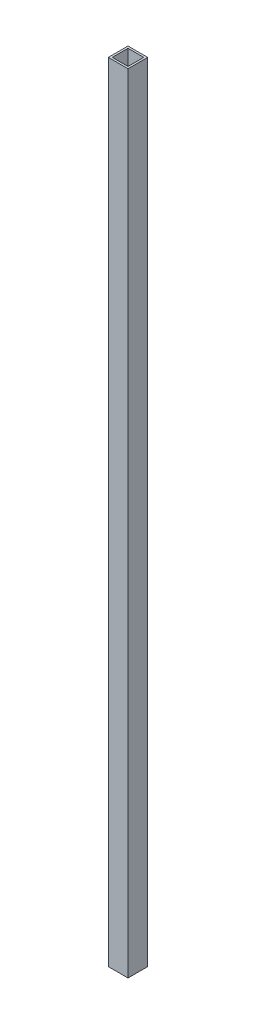
ISO-10303-21;
HEADER;
FILE_DESCRIPTION(('STEP AP214'),'2;1');
FILE_NAME('part.step','',(''),(''),'','','');
FILE_SCHEMA(('AUTOMOTIVE_DESIGN { 1 0 10303 214 1 1 1 1 }'));
ENDSEC;
DATA;
#1=APPLICATION_CONTEXT('core data for automotive mechanical design processes');
#2=APPLICATION_PROTOCOL_DEFINITION('international standard','automotive_design',2000,#1);
#3=PRODUCT_CONTEXT('',#1,'mechanical');
#4=PRODUCT('Part','Part','',(#3));
#5=PRODUCT_RELATED_PRODUCT_CATEGORY('part','',(#4));
#6=PRODUCT_DEFINITION_FORMATION('','',#4);
#7=PRODUCT_DEFINITION_CONTEXT('part definition',#1,'design');
#8=PRODUCT_DEFINITION('design','',#6,#7);
#9=PRODUCT_DEFINITION_SHAPE('','',#8);
#10=(LENGTH_UNIT() NAMED_UNIT(*) SI_UNIT(.MILLI.,.METRE.));
#11=(NAMED_UNIT(*) PLANE_ANGLE_UNIT() SI_UNIT($,.RADIAN.));
#12=(NAMED_UNIT(*) SI_UNIT($,.STERADIAN.) SOLID_ANGLE_UNIT());
#13=UNCERTAINTY_MEASURE_WITH_UNIT(LENGTH_MEASURE(1.E-05),#10,'distance_accuracy_value','');
#14=(GEOMETRIC_REPRESENTATION_CONTEXT(3) GLOBAL_UNCERTAINTY_ASSIGNED_CONTEXT((#13)) GLOBAL_UNIT_ASSIGNED_CONTEXT((#10,
#11,#12)) REPRESENTATION_CONTEXT('',''));
#15=CARTESIAN_POINT('',(0.,0.,0.));
#16=DIRECTION('',(0.,0.,1.));
#17=DIRECTION('',(1.,0.,0.));
#18=AXIS2_PLACEMENT_3D('',#15,#16,#17);
#19=CARTESIAN_POINT('',(-31.7391304347827,49.7826086956523,-20.));
#20=DIRECTION('',(-1.,0.,0.));
#21=DIRECTION('',(0.,-1.,0.));
#22=AXIS2_PLACEMENT_3D('',#19,#20,#21);
#23=PLANE('',#22);
#24=DIRECTION('',(0.,-1.,0.));
#25=VECTOR('',#24,1.);
#26=CARTESIAN_POINT('',(-31.7391304347827,49.7826086956523,0.));
#27=LINE('',#26,#25);
#28=CARTESIAN_POINT('',(-31.7391304347827,49.7826086956523,0.));
#29=VERTEX_POINT('',#28);
#30=CARTESIAN_POINT('',(-31.7391304347826,-750.217391304348,0.));
#31=VERTEX_POINT('',#30);
#32=EDGE_CURVE('E140',#29,#31,#27,.T.);
#33=ORIENTED_EDGE('',*,*,#32,.F.);
#34=DIRECTION('',(0.,0.,1.));
#35=VECTOR('',#34,1.);
#36=CARTESIAN_POINT('',(-31.7391304347827,49.7826086956523,-20.));
#37=LINE('',#36,#35);
#38=CARTESIAN_POINT('',(-31.7391304347827,49.7826086956523,-20.));
#39=VERTEX_POINT('',#38);
#40=EDGE_CURVE('E11',#39,#29,#37,.T.);
#41=ORIENTED_EDGE('',*,*,#40,.F.);
#42=DIRECTION('',(0.,-1.,0.));
#43=VECTOR('',#42,1.);
#44=CARTESIAN_POINT('',(-31.7391304347827,49.7826086956523,-20.));
#45=LINE('',#44,#43);
#46=CARTESIAN_POINT('',(-31.7391304347826,-750.217391304348,-20.));
#47=VERTEX_POINT('',#46);
#48=EDGE_CURVE('E144',#39,#47,#45,.T.);
#49=ORIENTED_EDGE('',*,*,#48,.T.);
#50=DIRECTION('',(0.,0.,1.));
#51=VECTOR('',#50,1.);
#52=CARTESIAN_POINT('',(-31.7391304347826,-750.217391304348,-20.));
#53=LINE('',#52,#51);
#54=EDGE_CURVE('E36',#47,#31,#53,.T.);
#55=ORIENTED_EDGE('',*,*,#54,.T.);
#56=EDGE_LOOP('',(#33,#41,#49,#55));
#57=FACE_BOUND('',#56,.T.);
#58=ADVANCED_FACE('F33',(#57),#23,.T.);
#59=CARTESIAN_POINT('',(-31.7391304347827,49.7826086956523,-20.));
#60=DIRECTION('',(0.,1.,0.));
#61=DIRECTION('',(0.,0.,1.));
#62=AXIS2_PLACEMENT_3D('',#59,#60,#61);
#63=PLANE('',#62);
#64=DIRECTION('',(0.,0.,1.));
#65=VECTOR('',#64,1.);
#66=CARTESIAN_POINT('',(-29.7391304347827,49.7826086956523,-18.));
#67=LINE('',#66,#65);
#68=CARTESIAN_POINT('',(-29.7391304347827,49.7826086956523,-18.));
#69=VERTEX_POINT('',#68);
#70=CARTESIAN_POINT('',(-29.7391304347827,49.7826086956523,-2.));
#71=VERTEX_POINT('',#70);
#72=EDGE_CURVE('E49',#69,#71,#67,.T.);
#73=ORIENTED_EDGE('',*,*,#72,.F.);
#74=DIRECTION('',(-1.,0.,0.));
#75=VECTOR('',#74,1.);
#76=CARTESIAN_POINT('',(-13.7391304347827,49.7826086956523,-18.));
#77=LINE('',#76,#75);
#78=CARTESIAN_POINT('',(-13.7391304347827,49.7826086956523,-18.));
#79=VERTEX_POINT('',#78);
#80=EDGE_CURVE('E125',#79,#69,#77,.T.);
#81=ORIENTED_EDGE('',*,*,#80,.F.);
#82=DIRECTION('',(0.,0.,-1.));
#83=VECTOR('',#82,1.);
#84=CARTESIAN_POINT('',(-13.7391304347827,49.7826086956523,-2.));
#85=LINE('',#84,#83);
#86=CARTESIAN_POINT('',(-13.7391304347827,49.7826086956523,-2.));
#87=VERTEX_POINT('',#86);
#88=EDGE_CURVE('E128',#87,#79,#85,.T.);
#89=ORIENTED_EDGE('',*,*,#88,.F.);
#90=DIRECTION('',(1.,0.,0.));
#91=VECTOR('',#90,1.);
#92=CARTESIAN_POINT('',(-29.7391304347827,49.7826086956523,-2.));
#93=LINE('',#92,#91);
#94=EDGE_CURVE('E134',#71,#87,#93,.T.);
#95=ORIENTED_EDGE('',*,*,#94,.F.);
#96=EDGE_LOOP('',(#73,#81,#89,#95));
#97=FACE_BOUND('',#96,.T.);
#98=DIRECTION('',(-1.,0.,0.));
#99=VECTOR('',#98,1.);
#100=CARTESIAN_POINT('',(-31.7391304347827,49.7826086956523,0.));
#101=LINE('',#100,#99);
#102=CARTESIAN_POINT('',(-11.7391304347827,49.7826086956523,0.));
#103=VERTEX_POINT('',#102);
#104=EDGE_CURVE('E147',#103,#29,#101,.T.);
#105=ORIENTED_EDGE('',*,*,#104,.F.);
#106=DIRECTION('',(0.,0.,1.));
#107=VECTOR('',#106,1.);
#108=CARTESIAN_POINT('',(-11.7391304347827,49.7826086956523,-20.));
#109=LINE('',#108,#107);
#110=CARTESIAN_POINT('',(-11.7391304347827,49.7826086956523,-20.));
#111=VERTEX_POINT('',#110);
#112=EDGE_CURVE('E41',#111,#103,#109,.T.);
#113=ORIENTED_EDGE('',*,*,#112,.F.);
#114=DIRECTION('',(-1.,0.,0.));
#115=VECTOR('',#114,1.);
#116=CARTESIAN_POINT('',(-31.7391304347827,49.7826086956523,-20.));
#117=LINE('',#116,#115);
#118=EDGE_CURVE('E152',#111,#39,#117,.T.);
#119=ORIENTED_EDGE('',*,*,#118,.T.);
#120=ORIENTED_EDGE('',*,*,#40,.T.);
#121=EDGE_LOOP('',(#105,#113,#119,#120));
#122=FACE_BOUND('',#121,.T.);
#123=ADVANCED_FACE('F169',(#97,#122),#63,.T.);
#124=CARTESIAN_POINT('',(-11.7391304347827,49.7826086956523,-20.));
#125=DIRECTION('',(1.,0.,0.));
#126=DIRECTION('',(0.,1.,0.));
#127=AXIS2_PLACEMENT_3D('',#124,#125,#126);
#128=PLANE('',#127);
#129=DIRECTION('',(0.,1.,0.));
#130=VECTOR('',#129,1.);
#131=CARTESIAN_POINT('',(-11.7391304347827,49.7826086956523,0.));
#132=LINE('',#131,#130);
#133=CARTESIAN_POINT('',(-11.7391304347826,-750.217391304348,0.));
#134=VERTEX_POINT('',#133);
#135=EDGE_CURVE('E159',#134,#103,#132,.T.);
#136=ORIENTED_EDGE('',*,*,#135,.F.);
#137=DIRECTION('',(0.,0.,1.));
#138=VECTOR('',#137,1.);
#139=CARTESIAN_POINT('',(-11.7391304347826,-750.217391304348,-20.));
#140=LINE('',#139,#138);
#141=CARTESIAN_POINT('',(-11.7391304347826,-750.217391304348,-20.));
#142=VERTEX_POINT('',#141);
#143=EDGE_CURVE('E164',#142,#134,#140,.T.);
#144=ORIENTED_EDGE('',*,*,#143,.F.);
#145=DIRECTION('',(0.,1.,0.));
#146=VECTOR('',#145,1.);
#147=CARTESIAN_POINT('',(-11.7391304347827,49.7826086956523,-20.));
#148=LINE('',#147,#146);
#149=EDGE_CURVE('E149',#142,#111,#148,.T.);
#150=ORIENTED_EDGE('',*,*,#149,.T.);
#151=ORIENTED_EDGE('',*,*,#112,.T.);
#152=EDGE_LOOP('',(#136,#144,#150,#151));
#153=FACE_BOUND('',#152,.T.);
#154=ADVANCED_FACE('F173',(#153),#128,.T.);
#155=CARTESIAN_POINT('',(-31.7391304347826,-750.217391304348,-20.));
#156=DIRECTION('',(0.,-1.,0.));
#157=DIRECTION('',(0.,0.,-1.));
#158=AXIS2_PLACEMENT_3D('',#155,#156,#157);
#159=PLANE('',#158);
#160=DIRECTION('',(1.,0.,0.));
#161=VECTOR('',#160,1.);
#162=CARTESIAN_POINT('',(-31.7391304347826,-750.217391304348,0.));
#163=LINE('',#162,#161);
#164=EDGE_CURVE('E156',#31,#134,#163,.T.);
#165=ORIENTED_EDGE('',*,*,#164,.F.);
#166=ORIENTED_EDGE('',*,*,#54,.F.);
#167=DIRECTION('',(1.,0.,0.));
#168=VECTOR('',#167,1.);
#169=CARTESIAN_POINT('',(-31.7391304347826,-750.217391304348,-20.));
#170=LINE('',#169,#168);
#171=EDGE_CURVE('E146',#47,#142,#170,.T.);
#172=ORIENTED_EDGE('',*,*,#171,.T.);
#173=ORIENTED_EDGE('',*,*,#143,.T.);
#174=EDGE_LOOP('',(#165,#166,#172,#173));
#175=FACE_BOUND('',#174,.T.);
#176=ADVANCED_FACE('F166',(#175),#159,.T.);
#177=CARTESIAN_POINT('',(0.,0.,-20.));
#178=DIRECTION('',(0.,0.,1.));
#179=DIRECTION('',(1.,0.,0.));
#180=AXIS2_PLACEMENT_3D('',#177,#178,#179);
#181=PLANE('',#180);
#182=ORIENTED_EDGE('',*,*,#48,.F.);
#183=ORIENTED_EDGE('',*,*,#118,.F.);
#184=ORIENTED_EDGE('',*,*,#149,.F.);
#185=ORIENTED_EDGE('',*,*,#171,.F.);
#186=EDGE_LOOP('',(#182,#183,#184,#185));
#187=FACE_BOUND('',#186,.T.);
#188=ADVANCED_FACE('F175',(#187),#181,.F.);
#189=CARTESIAN_POINT('',(0.,0.,0.));
#190=DIRECTION('',(0.,0.,1.));
#191=DIRECTION('',(1.,0.,0.));
#192=AXIS2_PLACEMENT_3D('',#189,#190,#191);
#193=PLANE('',#192);
#194=ORIENTED_EDGE('',*,*,#32,.T.);
#195=ORIENTED_EDGE('',*,*,#164,.T.);
#196=ORIENTED_EDGE('',*,*,#135,.T.);
#197=ORIENTED_EDGE('',*,*,#104,.T.);
#198=EDGE_LOOP('',(#194,#195,#196,#197));
#199=FACE_BOUND('',#198,.T.);
#200=ADVANCED_FACE('F168',(#199),#193,.T.);
#201=CARTESIAN_POINT('',(-29.7391304347827,-150.217391304348,-18.));
#202=DIRECTION('',(-1.,0.,0.));
#203=DIRECTION('',(0.,0.,1.));
#204=AXIS2_PLACEMENT_3D('',#201,#202,#203);
#205=PLANE('',#204);
#206=ORIENTED_EDGE('',*,*,#72,.T.);
#207=DIRECTION('',(0.,1.,0.));
#208=VECTOR('',#207,1.);
#209=CARTESIAN_POINT('',(-29.7391304347827,-150.217391304348,-2.));
#210=LINE('',#209,#208);
#211=CARTESIAN_POINT('',(-29.7391304347827,-150.217391304348,-2.));
#212=VERTEX_POINT('',#211);
#213=EDGE_CURVE('E103',#212,#71,#210,.T.);
#214=ORIENTED_EDGE('',*,*,#213,.F.);
#215=DIRECTION('',(0.,0.,1.));
#216=VECTOR('',#215,1.);
#217=CARTESIAN_POINT('',(-29.7391304347827,-150.217391304348,-18.));
#218=LINE('',#217,#216);
#219=CARTESIAN_POINT('',(-29.7391304347827,-150.217391304348,-18.));
#220=VERTEX_POINT('',#219);
#221=EDGE_CURVE('E107',#220,#212,#218,.T.);
#222=ORIENTED_EDGE('',*,*,#221,.F.);
#223=DIRECTION('',(0.,1.,0.));
#224=VECTOR('',#223,1.);
#225=CARTESIAN_POINT('',(-29.7391304347827,-150.217391304348,-18.));
#226=LINE('',#225,#224);
#227=EDGE_CURVE('E138',#220,#69,#226,.T.);
#228=ORIENTED_EDGE('',*,*,#227,.T.);
#229=EDGE_LOOP('',(#206,#214,#222,#228));
#230=FACE_BOUND('',#229,.T.);
#231=ADVANCED_FACE('F105',(#230),#205,.F.);
#232=CARTESIAN_POINT('',(-13.7391304347827,-150.217391304348,-18.));
#233=DIRECTION('',(0.,0.,-1.));
#234=DIRECTION('',(-1.,0.,0.));
#235=AXIS2_PLACEMENT_3D('',#232,#233,#234);
#236=PLANE('',#235);
#237=ORIENTED_EDGE('',*,*,#80,.T.);
#238=ORIENTED_EDGE('',*,*,#227,.F.);
#239=DIRECTION('',(-1.,0.,0.));
#240=VECTOR('',#239,1.);
#241=CARTESIAN_POINT('',(-13.7391304347827,-150.217391304348,-18.));
#242=LINE('',#241,#240);
#243=CARTESIAN_POINT('',(-13.7391304347827,-150.217391304348,-18.));
#244=VERTEX_POINT('',#243);
#245=EDGE_CURVE('E113',#244,#220,#242,.T.);
#246=ORIENTED_EDGE('',*,*,#245,.F.);
#247=DIRECTION('',(0.,1.,0.));
#248=VECTOR('',#247,1.);
#249=CARTESIAN_POINT('',(-13.7391304347827,-150.217391304348,-18.));
#250=LINE('',#249,#248);
#251=EDGE_CURVE('E141',#244,#79,#250,.T.);
#252=ORIENTED_EDGE('',*,*,#251,.T.);
#253=EDGE_LOOP('',(#237,#238,#246,#252));
#254=FACE_BOUND('',#253,.T.);
#255=ADVANCED_FACE('F199',(#254),#236,.F.);
#256=CARTESIAN_POINT('',(-13.7391304347827,-150.217391304348,-2.));
#257=DIRECTION('',(1.,0.,0.));
#258=DIRECTION('',(0.,0.,-1.));
#259=AXIS2_PLACEMENT_3D('',#256,#257,#258);
#260=PLANE('',#259);
#261=ORIENTED_EDGE('',*,*,#88,.T.);
#262=ORIENTED_EDGE('',*,*,#251,.F.);
#263=DIRECTION('',(0.,0.,-1.));
#264=VECTOR('',#263,1.);
#265=CARTESIAN_POINT('',(-13.7391304347827,-150.217391304348,-2.));
#266=LINE('',#265,#264);
#267=CARTESIAN_POINT('',(-13.7391304347827,-150.217391304348,-2.));
#268=VERTEX_POINT('',#267);
#269=EDGE_CURVE('E121',#268,#244,#266,.T.);
#270=ORIENTED_EDGE('',*,*,#269,.F.);
#271=DIRECTION('',(0.,1.,0.));
#272=VECTOR('',#271,1.);
#273=CARTESIAN_POINT('',(-13.7391304347827,-150.217391304348,-2.));
#274=LINE('',#273,#272);
#275=EDGE_CURVE('E112',#268,#87,#274,.T.);
#276=ORIENTED_EDGE('',*,*,#275,.T.);
#277=EDGE_LOOP('',(#261,#262,#270,#276));
#278=FACE_BOUND('',#277,.T.);
#279=ADVANCED_FACE('F197',(#278),#260,.F.);
#280=CARTESIAN_POINT('',(-29.7391304347827,-150.217391304348,-2.));
#281=DIRECTION('',(0.,0.,1.));
#282=DIRECTION('',(1.,0.,0.));
#283=AXIS2_PLACEMENT_3D('',#280,#281,#282);
#284=PLANE('',#283);
#285=ORIENTED_EDGE('',*,*,#94,.T.);
#286=ORIENTED_EDGE('',*,*,#275,.F.);
#287=DIRECTION('',(1.,0.,0.));
#288=VECTOR('',#287,1.);
#289=CARTESIAN_POINT('',(-29.7391304347827,-150.217391304348,-2.));
#290=LINE('',#289,#288);
#291=EDGE_CURVE('E116',#212,#268,#290,.T.);
#292=ORIENTED_EDGE('',*,*,#291,.F.);
#293=ORIENTED_EDGE('',*,*,#213,.T.);
#294=EDGE_LOOP('',(#285,#286,#292,#293));
#295=FACE_BOUND('',#294,.T.);
#296=ADVANCED_FACE('F117',(#295),#284,.F.);
#297=CARTESIAN_POINT('',(0.,-150.217391304348,0.));
#298=DIRECTION('',(0.,1.,0.));
#299=DIRECTION('',(0.,0.,1.));
#300=AXIS2_PLACEMENT_3D('',#297,#298,#299);
#301=PLANE('',#300);
#302=ORIENTED_EDGE('',*,*,#221,.T.);
#303=ORIENTED_EDGE('',*,*,#291,.T.);
#304=ORIENTED_EDGE('',*,*,#269,.T.);
#305=ORIENTED_EDGE('',*,*,#245,.T.);
#306=EDGE_LOOP('',(#302,#303,#304,#305));
#307=FACE_BOUND('',#306,.T.);
#308=ADVANCED_FACE('F123',(#307),#301,.T.);
#309=CLOSED_SHELL('',(#58,#123,#154,#176,#188,#200,#231,#255,#279,#296,#308));
#310=MANIFOLD_SOLID_BREP('B2',#309);
#311=ADVANCED_BREP_SHAPE_REPRESENTATION('',(#18,#310),#14);
#312=SHAPE_DEFINITION_REPRESENTATION(#9,#311);
ENDSEC;
END-ISO-10303-21;
